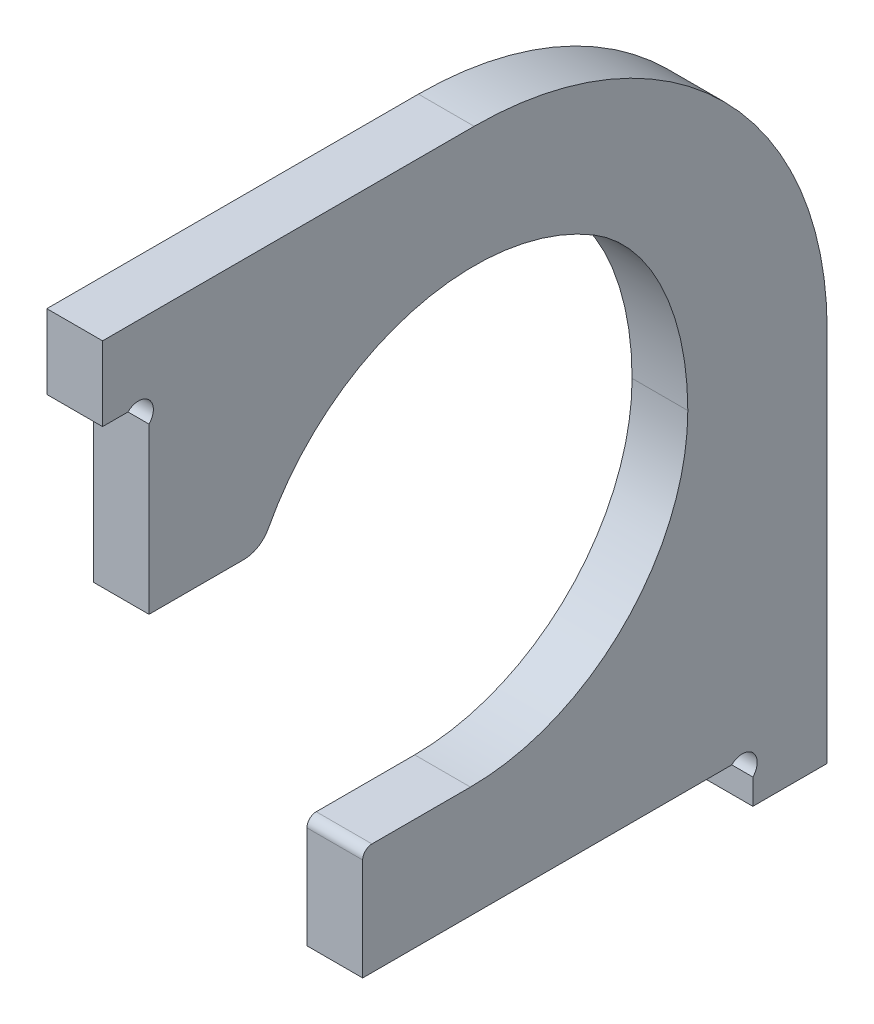
ISO-10303-21;
HEADER;
FILE_DESCRIPTION(('STEP AP214'),'2;1');
FILE_NAME('part.step','',(''),(''),'','','');
FILE_SCHEMA(('AUTOMOTIVE_DESIGN { 1 0 10303 214 1 1 1 1 }'));
ENDSEC;
DATA;
#1=APPLICATION_CONTEXT('core data for automotive mechanical design processes');
#2=APPLICATION_PROTOCOL_DEFINITION('international standard','automotive_design',2000,#1);
#3=PRODUCT_CONTEXT('',#1,'mechanical');
#4=PRODUCT('Part','Part','',(#3));
#5=PRODUCT_RELATED_PRODUCT_CATEGORY('part','',(#4));
#6=PRODUCT_DEFINITION_FORMATION('','',#4);
#7=PRODUCT_DEFINITION_CONTEXT('part definition',#1,'design');
#8=PRODUCT_DEFINITION('design','',#6,#7);
#9=PRODUCT_DEFINITION_SHAPE('','',#8);
#10=(LENGTH_UNIT() NAMED_UNIT(*) SI_UNIT(.MILLI.,.METRE.));
#11=(NAMED_UNIT(*) PLANE_ANGLE_UNIT() SI_UNIT($,.RADIAN.));
#12=(NAMED_UNIT(*) SI_UNIT($,.STERADIAN.) SOLID_ANGLE_UNIT());
#13=UNCERTAINTY_MEASURE_WITH_UNIT(LENGTH_MEASURE(1.E-05),#10,'distance_accuracy_value','');
#14=(GEOMETRIC_REPRESENTATION_CONTEXT(3) GLOBAL_UNCERTAINTY_ASSIGNED_CONTEXT((#13)) GLOBAL_UNIT_ASSIGNED_CONTEXT((#10,
#11,#12)) REPRESENTATION_CONTEXT('',''));
#15=CARTESIAN_POINT('',(0.,0.,0.));
#16=DIRECTION('',(0.,0.,1.));
#17=DIRECTION('',(1.,0.,0.));
#18=AXIS2_PLACEMENT_3D('',#15,#16,#17);
#19=CARTESIAN_POINT('',(6.,79.4,-1.));
#20=DIRECTION('',(0.,0.,-1.));
#21=DIRECTION('',(0.,1.,0.));
#22=AXIS2_PLACEMENT_3D('',#19,#20,#21);
#23=PLANE('',#22);
#24=DIRECTION('',(0.,-1.,0.));
#25=VECTOR('',#24,1.);
#26=CARTESIAN_POINT('',(0.,79.4,-1.));
#27=LINE('',#26,#25);
#28=CARTESIAN_POINT('',(0.,79.4,-1.));
#29=VERTEX_POINT('',#28);
#30=CARTESIAN_POINT('',(0.,71.4,-1.));
#31=VERTEX_POINT('',#30);
#32=EDGE_CURVE('E194',#29,#31,#27,.T.);
#33=ORIENTED_EDGE('',*,*,#32,.T.);
#34=DIRECTION('',(-1.,0.,0.));
#35=VECTOR('',#34,1.);
#36=CARTESIAN_POINT('',(6.,71.4,-1.));
#37=LINE('',#36,#35);
#38=CARTESIAN_POINT('',(6.,71.4,-1.));
#39=VERTEX_POINT('',#38);
#40=EDGE_CURVE('E11',#39,#31,#37,.T.);
#41=ORIENTED_EDGE('',*,*,#40,.F.);
#42=DIRECTION('',(0.,-1.,0.));
#43=VECTOR('',#42,1.);
#44=CARTESIAN_POINT('',(6.,79.4,-1.));
#45=LINE('',#44,#43);
#46=CARTESIAN_POINT('',(6.,79.4,-1.));
#47=VERTEX_POINT('',#46);
#48=EDGE_CURVE('E230',#47,#39,#45,.T.);
#49=ORIENTED_EDGE('',*,*,#48,.F.);
#50=DIRECTION('',(-1.,0.,0.));
#51=VECTOR('',#50,1.);
#52=CARTESIAN_POINT('',(6.,79.4,-1.));
#53=LINE('',#52,#51);
#54=EDGE_CURVE('E190',#47,#29,#53,.T.);
#55=ORIENTED_EDGE('',*,*,#54,.T.);
#56=EDGE_LOOP('',(#33,#41,#49,#55));
#57=FACE_BOUND('',#56,.T.);
#58=ADVANCED_FACE('F32',(#57),#23,.F.);
#59=CARTESIAN_POINT('',(6.,71.4,-1.));
#60=DIRECTION('',(0.,1.,-1.16609060809529E-13));
#61=DIRECTION('',(0.,1.16609060809529E-13,1.));
#62=AXIS2_PLACEMENT_3D('',#59,#60,#61);
#63=PLANE('',#62);
#64=DIRECTION('',(0.,-1.16609060809529E-13,-1.));
#65=VECTOR('',#64,1.);
#66=CARTESIAN_POINT('',(0.,71.4,-1.));
#67=LINE('',#66,#65);
#68=CARTESIAN_POINT('',(0.,71.3999999999997,-3.73725830020276));
#69=VERTEX_POINT('',#68);
#70=EDGE_CURVE('E197',#31,#69,#67,.T.);
#71=ORIENTED_EDGE('',*,*,#70,.T.);
#72=DIRECTION('',(-1.,0.,0.));
#73=VECTOR('',#72,1.);
#74=CARTESIAN_POINT('',(6.,71.3999999999997,-3.73725830020276));
#75=LINE('',#74,#73);
#76=CARTESIAN_POINT('',(6.,71.3999999999997,-3.73725830020276));
#77=VERTEX_POINT('',#76);
#78=EDGE_CURVE('E40',#77,#69,#75,.T.);
#79=ORIENTED_EDGE('',*,*,#78,.F.);
#80=DIRECTION('',(0.,-1.16609060809529E-13,-1.));
#81=VECTOR('',#80,1.);
#82=CARTESIAN_POINT('',(6.,71.4,-1.));
#83=LINE('',#82,#81);
#84=EDGE_CURVE('E124',#39,#77,#83,.T.);
#85=ORIENTED_EDGE('',*,*,#84,.F.);
#86=ORIENTED_EDGE('',*,*,#40,.T.);
#87=EDGE_LOOP('',(#71,#79,#85,#86));
#88=FACE_BOUND('',#87,.T.);
#89=ADVANCED_FACE('F330',(#88),#63,.F.);
#90=CARTESIAN_POINT('',(6.,70.2686291501015,-4.86862915010154));
#91=DIRECTION('',(-1.,0.,0.));
#92=DIRECTION('',(0.,0.,1.));
#93=AXIS2_PLACEMENT_3D('',#90,#91,#92);
#94=CYLINDRICAL_SURFACE('',#93,1.59999999999999);
#95=CARTESIAN_POINT('',(0.,70.2686291501015,-4.86862915010154));
#96=DIRECTION('',(-1.,0.,0.));
#97=DIRECTION('',(0.,0.,-1.));
#98=AXIS2_PLACEMENT_3D('',#95,#96,#97);
#99=CIRCLE('',#98,1.59999999999999);
#100=CARTESIAN_POINT('',(0.,69.137258300203,-6.));
#101=VERTEX_POINT('',#100);
#102=EDGE_CURVE('E199',#69,#101,#99,.T.);
#103=ORIENTED_EDGE('',*,*,#102,.T.);
#104=DIRECTION('',(-1.,0.,0.));
#105=VECTOR('',#104,1.);
#106=CARTESIAN_POINT('',(6.,69.137258300203,-6.));
#107=LINE('',#106,#105);
#108=CARTESIAN_POINT('',(6.,69.137258300203,-6.));
#109=VERTEX_POINT('',#108);
#110=EDGE_CURVE('E270',#109,#101,#107,.T.);
#111=ORIENTED_EDGE('',*,*,#110,.F.);
#112=CARTESIAN_POINT('',(6.,70.2686291501015,-4.86862915010154));
#113=DIRECTION('',(-1.,0.,0.));
#114=DIRECTION('',(0.,0.,-1.));
#115=AXIS2_PLACEMENT_3D('',#112,#113,#114);
#116=CIRCLE('',#115,1.59999999999999);
#117=EDGE_CURVE('E278',#77,#109,#116,.T.);
#118=ORIENTED_EDGE('',*,*,#117,.F.);
#119=ORIENTED_EDGE('',*,*,#78,.T.);
#120=EDGE_LOOP('',(#103,#111,#118,#119));
#121=FACE_BOUND('',#120,.T.);
#122=ADVANCED_FACE('F276',(#121),#94,.F.);
#123=CARTESIAN_POINT('',(6.,51.4,-6.));
#124=DIRECTION('',(0.,0.,-1.));
#125=DIRECTION('',(-1.,0.,0.));
#126=AXIS2_PLACEMENT_3D('',#123,#124,#125);
#127=PLANE('',#126);
#128=DIRECTION('',(0.,-1.,0.));
#129=VECTOR('',#128,1.);
#130=CARTESIAN_POINT('',(0.,51.4,-6.));
#131=LINE('',#130,#129);
#132=CARTESIAN_POINT('',(0.,51.4,-6.));
#133=VERTEX_POINT('',#132);
#134=EDGE_CURVE('E201',#101,#133,#131,.T.);
#135=ORIENTED_EDGE('',*,*,#134,.T.);
#136=DIRECTION('',(-1.,0.,0.));
#137=VECTOR('',#136,1.);
#138=CARTESIAN_POINT('',(6.,51.4,-6.));
#139=LINE('',#138,#137);
#140=CARTESIAN_POINT('',(6.,51.4,-6.));
#141=VERTEX_POINT('',#140);
#142=EDGE_CURVE('E267',#141,#133,#139,.T.);
#143=ORIENTED_EDGE('',*,*,#142,.F.);
#144=DIRECTION('',(0.,-1.,0.));
#145=VECTOR('',#144,1.);
#146=CARTESIAN_POINT('',(6.,51.4,-6.));
#147=LINE('',#146,#145);
#148=EDGE_CURVE('E296',#109,#141,#147,.T.);
#149=ORIENTED_EDGE('',*,*,#148,.F.);
#150=ORIENTED_EDGE('',*,*,#110,.T.);
#151=EDGE_LOOP('',(#135,#143,#149,#150));
#152=FACE_BOUND('',#151,.T.);
#153=ADVANCED_FACE('F287',(#152),#127,.F.);
#154=CARTESIAN_POINT('',(6.,51.4,-6.));
#155=DIRECTION('',(0.,1.,0.));
#156=DIRECTION('',(0.,0.,1.));
#157=AXIS2_PLACEMENT_3D('',#154,#155,#156);
#158=PLANE('',#157);
#159=DIRECTION('',(0.,0.,-1.));
#160=VECTOR('',#159,1.);
#161=CARTESIAN_POINT('',(0.,51.4,-6.));
#162=LINE('',#161,#160);
#163=CARTESIAN_POINT('',(0.,51.4,-16.2008064647256));
#164=VERTEX_POINT('',#163);
#165=EDGE_CURVE('E203',#133,#164,#162,.T.);
#166=ORIENTED_EDGE('',*,*,#165,.T.);
#167=DIRECTION('',(-1.,0.,0.));
#168=VECTOR('',#167,1.);
#169=CARTESIAN_POINT('',(6.,51.4,-16.2008064647256));
#170=LINE('',#169,#168);
#171=CARTESIAN_POINT('',(6.,51.4,-16.2008064647256));
#172=VERTEX_POINT('',#171);
#173=EDGE_CURVE('E264',#172,#164,#170,.T.);
#174=ORIENTED_EDGE('',*,*,#173,.F.);
#175=DIRECTION('',(0.,0.,-1.));
#176=VECTOR('',#175,1.);
#177=CARTESIAN_POINT('',(6.,51.4,-6.));
#178=LINE('',#177,#176);
#179=EDGE_CURVE('E293',#141,#172,#178,.T.);
#180=ORIENTED_EDGE('',*,*,#179,.F.);
#181=ORIENTED_EDGE('',*,*,#142,.T.);
#182=EDGE_LOOP('',(#166,#174,#180,#181));
#183=FACE_BOUND('',#182,.T.);
#184=ADVANCED_FACE('F291',(#183),#158,.F.);
#185=CARTESIAN_POINT('',(6.,54.4,-16.2008064647256));
#186=DIRECTION('',(-1.,0.,0.));
#187=DIRECTION('',(0.,0.,1.));
#188=AXIS2_PLACEMENT_3D('',#185,#186,#187);
#189=CYLINDRICAL_SURFACE('',#188,3.);
#190=CARTESIAN_POINT('',(0.,54.4,-16.2008064647256));
#191=DIRECTION('',(1.,0.,0.));
#192=DIRECTION('',(0.,0.,-1.));
#193=AXIS2_PLACEMENT_3D('',#190,#191,#192);
#194=CIRCLE('',#193,3.);
#195=CARTESIAN_POINT('',(0.,53.0071428571429,-18.8578629149336));
#196=VERTEX_POINT('',#195);
#197=EDGE_CURVE('E205',#164,#196,#194,.T.);
#198=ORIENTED_EDGE('',*,*,#197,.T.);
#199=DIRECTION('',(-1.,0.,0.));
#200=VECTOR('',#199,1.);
#201=CARTESIAN_POINT('',(6.,53.0071428571429,-18.8578629149336));
#202=LINE('',#201,#200);
#203=CARTESIAN_POINT('',(6.,53.0071428571429,-18.8578629149336));
#204=VERTEX_POINT('',#203);
#205=EDGE_CURVE('E261',#204,#196,#202,.T.);
#206=ORIENTED_EDGE('',*,*,#205,.F.);
#207=CARTESIAN_POINT('',(6.,54.4,-16.2008064647256));
#208=DIRECTION('',(1.,0.,0.));
#209=DIRECTION('',(0.,0.,-1.));
#210=AXIS2_PLACEMENT_3D('',#207,#208,#209);
#211=CIRCLE('',#210,3.);
#212=EDGE_CURVE('E295',#172,#204,#211,.T.);
#213=ORIENTED_EDGE('',*,*,#212,.F.);
#214=ORIENTED_EDGE('',*,*,#173,.T.);
#215=EDGE_LOOP('',(#198,#206,#213,#214));
#216=FACE_BOUND('',#215,.T.);
#217=ADVANCED_FACE('F320',(#216),#189,.T.);
#218=CARTESIAN_POINT('',(6.,41.4,-41.));
#219=DIRECTION('',(-1.,0.,0.));
#220=DIRECTION('',(0.,0.,1.));
#221=AXIS2_PLACEMENT_3D('',#218,#219,#220);
#222=CYLINDRICAL_SURFACE('',#221,24.9999999999999);
#223=CARTESIAN_POINT('',(0.,41.4,-41.));
#224=DIRECTION('',(-1.,0.,0.));
#225=DIRECTION('',(0.,0.,-1.));
#226=AXIS2_PLACEMENT_3D('',#223,#224,#225);
#227=CIRCLE('',#226,24.9999999999999);
#228=CARTESIAN_POINT('',(0.,62.8526343053635,-53.8368407858141));
#229=VERTEX_POINT('',#228);
#230=EDGE_CURVE('E207',#196,#229,#227,.T.);
#231=ORIENTED_EDGE('',*,*,#230,.T.);
#232=DIRECTION('',(-1.,0.,0.));
#233=VECTOR('',#232,1.);
#234=CARTESIAN_POINT('',(6.,62.8526343053635,-53.8368407858141));
#235=LINE('',#234,#233);
#236=CARTESIAN_POINT('',(6.,62.8526343053635,-53.8368407858141));
#237=VERTEX_POINT('',#236);
#238=EDGE_CURVE('E258',#237,#229,#235,.T.);
#239=ORIENTED_EDGE('',*,*,#238,.F.);
#240=CARTESIAN_POINT('',(6.,41.4,-41.));
#241=DIRECTION('',(-1.,0.,0.));
#242=DIRECTION('',(0.,0.,-1.));
#243=AXIS2_PLACEMENT_3D('',#240,#241,#242);
#244=CIRCLE('',#243,24.9999999999999);
#245=EDGE_CURVE('E298',#204,#237,#244,.T.);
#246=ORIENTED_EDGE('',*,*,#245,.F.);
#247=ORIENTED_EDGE('',*,*,#205,.T.);
#248=EDGE_LOOP('',(#231,#239,#246,#247));
#249=FACE_BOUND('',#248,.T.);
#250=ADVANCED_FACE('F315',(#249),#222,.F.);
#251=CARTESIAN_POINT('',(6.,41.4,-47.183641527081));
#252=DIRECTION('',(-1.,0.,0.));
#253=DIRECTION('',(0.,1.,0.));
#254=AXIS2_PLACEMENT_3D('',#251,#252,#253);
#255=ELLIPSE('',#254,23.3585440094265,16.8163584729185);
#256=DIRECTION('',(-1.,0.,0.));
#257=VECTOR('',#256,1.);
#258=SURFACE_OF_LINEAR_EXTRUSION('',#255,#257);
#259=CARTESIAN_POINT('',(0.,41.4,-47.183641527081));
#260=DIRECTION('',(-1.,0.,0.));
#261=DIRECTION('',(0.,1.,0.));
#262=AXIS2_PLACEMENT_3D('',#259,#260,#261);
#263=ELLIPSE('',#262,23.3585440094265,16.8163584729185);
#264=CARTESIAN_POINT('',(0.,41.4,-63.9999999999995));
#265=VERTEX_POINT('',#264);
#266=EDGE_CURVE('E209',#229,#265,#263,.T.);
#267=ORIENTED_EDGE('',*,*,#266,.T.);
#268=DIRECTION('',(-1.,0.,0.));
#269=VECTOR('',#268,1.);
#270=CARTESIAN_POINT('',(6.,41.4,-63.9999999999995));
#271=LINE('',#270,#269);
#272=CARTESIAN_POINT('',(6.,41.4,-63.9999999999995));
#273=VERTEX_POINT('',#272);
#274=EDGE_CURVE('E255',#273,#265,#271,.T.);
#275=ORIENTED_EDGE('',*,*,#274,.F.);
#276=EDGE_CURVE('E304',#237,#273,#255,.T.);
#277=ORIENTED_EDGE('',*,*,#276,.F.);
#278=ORIENTED_EDGE('',*,*,#238,.T.);
#279=EDGE_LOOP('',(#267,#275,#277,#278));
#280=FACE_BOUND('',#279,.T.);
#281=ADVANCED_FACE('F310',(#280),#258,.F.);
#282=CARTESIAN_POINT('',(6.,41.4,-40.5999999999994));
#283=DIRECTION('',(-1.,0.,0.));
#284=DIRECTION('',(0.,0.,1.));
#285=AXIS2_PLACEMENT_3D('',#282,#283,#284);
#286=CYLINDRICAL_SURFACE('',#285,23.4000000000001);
#287=CARTESIAN_POINT('',(0.,41.4,-40.5999999999994));
#288=DIRECTION('',(-1.,0.,0.));
#289=DIRECTION('',(0.,0.,-1.));
#290=AXIS2_PLACEMENT_3D('',#287,#288,#289);
#291=CIRCLE('',#290,23.4000000000001);
#292=CARTESIAN_POINT('',(0.,18.,-40.5999999999994));
#293=VERTEX_POINT('',#292);
#294=EDGE_CURVE('E211',#265,#293,#291,.T.);
#295=ORIENTED_EDGE('',*,*,#294,.T.);
#296=DIRECTION('',(-1.,0.,0.));
#297=VECTOR('',#296,1.);
#298=CARTESIAN_POINT('',(6.,18.,-40.5999999999994));
#299=LINE('',#298,#297);
#300=CARTESIAN_POINT('',(6.,18.,-40.5999999999994));
#301=VERTEX_POINT('',#300);
#302=EDGE_CURVE('E252',#301,#293,#299,.T.);
#303=ORIENTED_EDGE('',*,*,#302,.F.);
#304=CARTESIAN_POINT('',(6.,41.4,-40.5999999999994));
#305=DIRECTION('',(-1.,0.,0.));
#306=DIRECTION('',(0.,0.,-1.));
#307=AXIS2_PLACEMENT_3D('',#304,#305,#306);
#308=CIRCLE('',#307,23.4000000000001);
#309=EDGE_CURVE('E307',#273,#301,#308,.T.);
#310=ORIENTED_EDGE('',*,*,#309,.F.);
#311=ORIENTED_EDGE('',*,*,#274,.T.);
#312=EDGE_LOOP('',(#295,#303,#310,#311));
#313=FACE_BOUND('',#312,.T.);
#314=ADVANCED_FACE('F314',(#313),#286,.F.);
#315=CARTESIAN_POINT('',(6.,18.,-40.5999999999994));
#316=DIRECTION('',(0.,-1.,0.));
#317=DIRECTION('',(0.,0.,-1.));
#318=AXIS2_PLACEMENT_3D('',#315,#316,#317);
#319=PLANE('',#318);
#320=DIRECTION('',(0.,0.,1.));
#321=VECTOR('',#320,1.);
#322=CARTESIAN_POINT('',(0.,18.,-40.5999999999994));
#323=LINE('',#322,#321);
#324=CARTESIAN_POINT('',(0.,18.,-29.9999999999995));
#325=VERTEX_POINT('',#324);
#326=EDGE_CURVE('E213',#293,#325,#323,.T.);
#327=ORIENTED_EDGE('',*,*,#326,.T.);
#328=DIRECTION('',(-1.,0.,0.));
#329=VECTOR('',#328,1.);
#330=CARTESIAN_POINT('',(6.,18.,-29.9999999999995));
#331=LINE('',#330,#329);
#332=CARTESIAN_POINT('',(6.,18.,-29.9999999999995));
#333=VERTEX_POINT('',#332);
#334=EDGE_CURVE('E249',#333,#325,#331,.T.);
#335=ORIENTED_EDGE('',*,*,#334,.F.);
#336=DIRECTION('',(0.,0.,1.));
#337=VECTOR('',#336,1.);
#338=CARTESIAN_POINT('',(6.,18.,-40.5999999999994));
#339=LINE('',#338,#337);
#340=EDGE_CURVE('E379',#301,#333,#339,.T.);
#341=ORIENTED_EDGE('',*,*,#340,.F.);
#342=ORIENTED_EDGE('',*,*,#302,.T.);
#343=EDGE_LOOP('',(#327,#335,#341,#342));
#344=FACE_BOUND('',#343,.T.);
#345=ADVANCED_FACE('F376',(#344),#319,.F.);
#346=CARTESIAN_POINT('',(6.,17.,-29.9999999999995));
#347=DIRECTION('',(-1.,0.,0.));
#348=DIRECTION('',(0.,0.,1.));
#349=AXIS2_PLACEMENT_3D('',#346,#347,#348);
#350=CYLINDRICAL_SURFACE('',#349,1.);
#351=CARTESIAN_POINT('',(0.,17.,-29.9999999999995));
#352=DIRECTION('',(1.,0.,0.));
#353=DIRECTION('',(0.,0.,-1.));
#354=AXIS2_PLACEMENT_3D('',#351,#352,#353);
#355=CIRCLE('',#354,1.);
#356=CARTESIAN_POINT('',(0.,17.,-28.9999999999995));
#357=VERTEX_POINT('',#356);
#358=EDGE_CURVE('E215',#325,#357,#355,.T.);
#359=ORIENTED_EDGE('',*,*,#358,.T.);
#360=DIRECTION('',(-1.,0.,0.));
#361=VECTOR('',#360,1.);
#362=CARTESIAN_POINT('',(6.,17.,-28.9999999999995));
#363=LINE('',#362,#361);
#364=CARTESIAN_POINT('',(6.,17.,-28.9999999999995));
#365=VERTEX_POINT('',#364);
#366=EDGE_CURVE('E246',#365,#357,#363,.T.);
#367=ORIENTED_EDGE('',*,*,#366,.F.);
#368=CARTESIAN_POINT('',(6.,17.,-29.9999999999995));
#369=DIRECTION('',(1.,0.,0.));
#370=DIRECTION('',(0.,0.,-1.));
#371=AXIS2_PLACEMENT_3D('',#368,#369,#370);
#372=CIRCLE('',#371,1.);
#373=EDGE_CURVE('E370',#333,#365,#372,.T.);
#374=ORIENTED_EDGE('',*,*,#373,.F.);
#375=ORIENTED_EDGE('',*,*,#334,.T.);
#376=EDGE_LOOP('',(#359,#367,#374,#375));
#377=FACE_BOUND('',#376,.T.);
#378=ADVANCED_FACE('F369',(#377),#350,.T.);
#379=CARTESIAN_POINT('',(6.,17.,-28.9999999999995));
#380=DIRECTION('',(0.,0.,-1.));
#381=DIRECTION('',(-1.,0.,0.));
#382=AXIS2_PLACEMENT_3D('',#379,#380,#381);
#383=PLANE('',#382);
#384=DIRECTION('',(0.,-1.,0.));
#385=VECTOR('',#384,1.);
#386=CARTESIAN_POINT('',(0.,17.,-28.9999999999995));
#387=LINE('',#386,#385);
#388=CARTESIAN_POINT('',(0.,6.,-28.9999999999995));
#389=VERTEX_POINT('',#388);
#390=EDGE_CURVE('E217',#357,#389,#387,.T.);
#391=ORIENTED_EDGE('',*,*,#390,.T.);
#392=DIRECTION('',(-1.,0.,0.));
#393=VECTOR('',#392,1.);
#394=CARTESIAN_POINT('',(6.,6.,-28.9999999999995));
#395=LINE('',#394,#393);
#396=CARTESIAN_POINT('',(6.,6.,-28.9999999999995));
#397=VERTEX_POINT('',#396);
#398=EDGE_CURVE('E243',#397,#389,#395,.T.);
#399=ORIENTED_EDGE('',*,*,#398,.F.);
#400=DIRECTION('',(0.,-1.,0.));
#401=VECTOR('',#400,1.);
#402=CARTESIAN_POINT('',(6.,17.,-28.9999999999995));
#403=LINE('',#402,#401);
#404=EDGE_CURVE('E365',#365,#397,#403,.T.);
#405=ORIENTED_EDGE('',*,*,#404,.F.);
#406=ORIENTED_EDGE('',*,*,#366,.T.);
#407=EDGE_LOOP('',(#391,#399,#405,#406));
#408=FACE_BOUND('',#407,.T.);
#409=ADVANCED_FACE('F364',(#408),#383,.F.);
#410=CARTESIAN_POINT('',(6.,6.,-28.9999999999995));
#411=DIRECTION('',(0.,1.,0.));
#412=DIRECTION('',(0.,0.,1.));
#413=AXIS2_PLACEMENT_3D('',#410,#411,#412);
#414=PLANE('',#413);
#415=DIRECTION('',(0.,0.,-1.));
#416=VECTOR('',#415,1.);
#417=CARTESIAN_POINT('',(0.,6.,-28.9999999999995));
#418=LINE('',#417,#416);
#419=CARTESIAN_POINT('',(0.,6.,-68.7372583002031));
#420=VERTEX_POINT('',#419);
#421=EDGE_CURVE('E219',#389,#420,#418,.T.);
#422=ORIENTED_EDGE('',*,*,#421,.T.);
#423=DIRECTION('',(-1.,0.,0.));
#424=VECTOR('',#423,1.);
#425=CARTESIAN_POINT('',(6.,6.,-68.7372583002031));
#426=LINE('',#425,#424);
#427=CARTESIAN_POINT('',(6.,6.,-68.7372583002031));
#428=VERTEX_POINT('',#427);
#429=EDGE_CURVE('E240',#428,#420,#426,.T.);
#430=ORIENTED_EDGE('',*,*,#429,.F.);
#431=DIRECTION('',(0.,0.,-1.));
#432=VECTOR('',#431,1.);
#433=CARTESIAN_POINT('',(6.,6.,-28.9999999999995));
#434=LINE('',#433,#432);
#435=EDGE_CURVE('E361',#397,#428,#434,.T.);
#436=ORIENTED_EDGE('',*,*,#435,.F.);
#437=ORIENTED_EDGE('',*,*,#398,.T.);
#438=EDGE_LOOP('',(#422,#430,#436,#437));
#439=FACE_BOUND('',#438,.T.);
#440=ADVANCED_FACE('F358',(#439),#414,.F.);
#441=CARTESIAN_POINT('',(6.,4.86862915010152,-69.8686291501015));
#442=DIRECTION('',(-1.,0.,0.));
#443=DIRECTION('',(0.,0.,1.));
#444=AXIS2_PLACEMENT_3D('',#441,#442,#443);
#445=CYLINDRICAL_SURFACE('',#444,1.59999999999999);
#446=CARTESIAN_POINT('',(0.,4.86862915010152,-69.8686291501015));
#447=DIRECTION('',(-1.,0.,0.));
#448=DIRECTION('',(0.,0.,-1.));
#449=AXIS2_PLACEMENT_3D('',#446,#447,#448);
#450=CIRCLE('',#449,1.59999999999999);
#451=CARTESIAN_POINT('',(0.,3.73725830020235,-70.9999999999993));
#452=VERTEX_POINT('',#451);
#453=EDGE_CURVE('E221',#420,#452,#450,.T.);
#454=ORIENTED_EDGE('',*,*,#453,.T.);
#455=DIRECTION('',(-1.,0.,0.));
#456=VECTOR('',#455,1.);
#457=CARTESIAN_POINT('',(6.,3.73725830020235,-70.9999999999993));
#458=LINE('',#457,#456);
#459=CARTESIAN_POINT('',(6.,3.73725830020235,-70.9999999999993));
#460=VERTEX_POINT('',#459);
#461=EDGE_CURVE('E237',#460,#452,#458,.T.);
#462=ORIENTED_EDGE('',*,*,#461,.F.);
#463=CARTESIAN_POINT('',(6.,4.86862915010152,-69.8686291501015));
#464=DIRECTION('',(-1.,0.,0.));
#465=DIRECTION('',(0.,0.,-1.));
#466=AXIS2_PLACEMENT_3D('',#463,#464,#465);
#467=CIRCLE('',#466,1.59999999999999);
#468=EDGE_CURVE('E352',#428,#460,#467,.T.);
#469=ORIENTED_EDGE('',*,*,#468,.F.);
#470=ORIENTED_EDGE('',*,*,#429,.T.);
#471=EDGE_LOOP('',(#454,#462,#469,#470));
#472=FACE_BOUND('',#471,.T.);
#473=ADVANCED_FACE('F351',(#472),#445,.F.);
#474=CARTESIAN_POINT('',(6.,3.73725830020235,-70.9999999999993));
#475=DIRECTION('',(0.,2.53497958281624E-13,-1.));
#476=DIRECTION('',(0.,1.,2.53497958281624E-13));
#477=AXIS2_PLACEMENT_3D('',#474,#475,#476);
#478=PLANE('',#477);
#479=DIRECTION('',(0.,-1.,-2.53497958281624E-13));
#480=VECTOR('',#479,1.);
#481=CARTESIAN_POINT('',(0.,3.73725830020235,-70.9999999999993));
#482=LINE('',#481,#480);
#483=CARTESIAN_POINT('',(0.,0.999999999999997,-71.));
#484=VERTEX_POINT('',#483);
#485=EDGE_CURVE('E223',#452,#484,#482,.T.);
#486=ORIENTED_EDGE('',*,*,#485,.T.);
#487=DIRECTION('',(-1.,0.,0.));
#488=VECTOR('',#487,1.);
#489=CARTESIAN_POINT('',(6.,0.999999999999997,-71.));
#490=LINE('',#489,#488);
#491=CARTESIAN_POINT('',(6.,0.999999999999997,-71.));
#492=VERTEX_POINT('',#491);
#493=EDGE_CURVE('E234',#492,#484,#490,.T.);
#494=ORIENTED_EDGE('',*,*,#493,.F.);
#495=DIRECTION('',(0.,-1.,-2.53497958281624E-13));
#496=VECTOR('',#495,1.);
#497=CARTESIAN_POINT('',(6.,3.73725830020235,-70.9999999999993));
#498=LINE('',#497,#496);
#499=EDGE_CURVE('E347',#460,#492,#498,.T.);
#500=ORIENTED_EDGE('',*,*,#499,.F.);
#501=ORIENTED_EDGE('',*,*,#461,.T.);
#502=EDGE_LOOP('',(#486,#494,#500,#501));
#503=FACE_BOUND('',#502,.T.);
#504=ADVANCED_FACE('F346',(#503),#478,.F.);
#505=CARTESIAN_POINT('',(6.,0.999999999999997,-71.));
#506=DIRECTION('',(0.,1.,0.));
#507=DIRECTION('',(0.,0.,1.));
#508=AXIS2_PLACEMENT_3D('',#505,#506,#507);
#509=PLANE('',#508);
#510=DIRECTION('',(0.,0.,-1.));
#511=VECTOR('',#510,1.);
#512=CARTESIAN_POINT('',(0.,0.999999999999997,-71.));
#513=LINE('',#512,#511);
#514=CARTESIAN_POINT('',(0.,1.,-79.));
#515=VERTEX_POINT('',#514);
#516=EDGE_CURVE('E225',#484,#515,#513,.T.);
#517=ORIENTED_EDGE('',*,*,#516,.T.);
#518=DIRECTION('',(-1.,0.,0.));
#519=VECTOR('',#518,1.);
#520=CARTESIAN_POINT('',(6.,1.,-79.));
#521=LINE('',#520,#519);
#522=CARTESIAN_POINT('',(6.,1.,-79.));
#523=VERTEX_POINT('',#522);
#524=EDGE_CURVE('E185',#523,#515,#521,.T.);
#525=ORIENTED_EDGE('',*,*,#524,.F.);
#526=DIRECTION('',(0.,0.,-1.));
#527=VECTOR('',#526,1.);
#528=CARTESIAN_POINT('',(6.,0.999999999999997,-71.));
#529=LINE('',#528,#527);
#530=EDGE_CURVE('E176',#492,#523,#529,.T.);
#531=ORIENTED_EDGE('',*,*,#530,.F.);
#532=ORIENTED_EDGE('',*,*,#493,.T.);
#533=EDGE_LOOP('',(#517,#525,#531,#532));
#534=FACE_BOUND('',#533,.T.);
#535=ADVANCED_FACE('F342',(#534),#509,.F.);
#536=CARTESIAN_POINT('',(6.,41.4,-79.));
#537=DIRECTION('',(0.,0.,1.));
#538=DIRECTION('',(1.,0.,0.));
#539=AXIS2_PLACEMENT_3D('',#536,#537,#538);
#540=PLANE('',#539);
#541=DIRECTION('',(0.,1.,0.));
#542=VECTOR('',#541,1.);
#543=CARTESIAN_POINT('',(0.,41.4,-79.));
#544=LINE('',#543,#542);
#545=CARTESIAN_POINT('',(0.,41.4,-79.));
#546=VERTEX_POINT('',#545);
#547=EDGE_CURVE('E184',#515,#546,#544,.T.);
#548=ORIENTED_EDGE('',*,*,#547,.T.);
#549=DIRECTION('',(-1.,0.,0.));
#550=VECTOR('',#549,1.);
#551=CARTESIAN_POINT('',(6.,41.4,-79.));
#552=LINE('',#551,#550);
#553=CARTESIAN_POINT('',(6.,41.4,-79.));
#554=VERTEX_POINT('',#553);
#555=EDGE_CURVE('E181',#554,#546,#552,.T.);
#556=ORIENTED_EDGE('',*,*,#555,.F.);
#557=DIRECTION('',(0.,1.,0.));
#558=VECTOR('',#557,1.);
#559=CARTESIAN_POINT('',(6.,41.4,-79.));
#560=LINE('',#559,#558);
#561=EDGE_CURVE('E170',#523,#554,#560,.T.);
#562=ORIENTED_EDGE('',*,*,#561,.F.);
#563=ORIENTED_EDGE('',*,*,#524,.T.);
#564=EDGE_LOOP('',(#548,#556,#562,#563));
#565=FACE_BOUND('',#564,.T.);
#566=ADVANCED_FACE('F182',(#565),#540,.F.);
#567=CARTESIAN_POINT('',(6.,41.4,-41.));
#568=DIRECTION('',(-1.,0.,0.));
#569=DIRECTION('',(0.,0.,1.));
#570=AXIS2_PLACEMENT_3D('',#567,#568,#569);
#571=CYLINDRICAL_SURFACE('',#570,38.);
#572=CARTESIAN_POINT('',(0.,41.4,-41.));
#573=DIRECTION('',(1.,0.,0.));
#574=DIRECTION('',(0.,0.,-1.));
#575=AXIS2_PLACEMENT_3D('',#572,#573,#574);
#576=CIRCLE('',#575,38.);
#577=CARTESIAN_POINT('',(0.,79.4,-41.));
#578=VERTEX_POINT('',#577);
#579=EDGE_CURVE('E110',#546,#578,#576,.T.);
#580=ORIENTED_EDGE('',*,*,#579,.T.);
#581=DIRECTION('',(-1.,0.,0.));
#582=VECTOR('',#581,1.);
#583=CARTESIAN_POINT('',(6.,79.4,-41.));
#584=LINE('',#583,#582);
#585=CARTESIAN_POINT('',(6.,79.4,-41.));
#586=VERTEX_POINT('',#585);
#587=EDGE_CURVE('E186',#586,#578,#584,.T.);
#588=ORIENTED_EDGE('',*,*,#587,.F.);
#589=CARTESIAN_POINT('',(6.,41.4,-41.));
#590=DIRECTION('',(1.,0.,0.));
#591=DIRECTION('',(0.,0.,-1.));
#592=AXIS2_PLACEMENT_3D('',#589,#590,#591);
#593=CIRCLE('',#592,38.);
#594=EDGE_CURVE('E174',#554,#586,#593,.T.);
#595=ORIENTED_EDGE('',*,*,#594,.F.);
#596=ORIENTED_EDGE('',*,*,#555,.T.);
#597=EDGE_LOOP('',(#580,#588,#595,#596));
#598=FACE_BOUND('',#597,.T.);
#599=ADVANCED_FACE('F188',(#598),#571,.T.);
#600=CARTESIAN_POINT('',(6.,79.4,-41.));
#601=DIRECTION('',(0.,-1.,0.));
#602=DIRECTION('',(0.,0.,-1.));
#603=AXIS2_PLACEMENT_3D('',#600,#601,#602);
#604=PLANE('',#603);
#605=DIRECTION('',(0.,0.,1.));
#606=VECTOR('',#605,1.);
#607=CARTESIAN_POINT('',(0.,79.4,-41.));
#608=LINE('',#607,#606);
#609=EDGE_CURVE('E116',#578,#29,#608,.T.);
#610=ORIENTED_EDGE('',*,*,#609,.T.);
#611=ORIENTED_EDGE('',*,*,#54,.F.);
#612=DIRECTION('',(0.,0.,1.));
#613=VECTOR('',#612,1.);
#614=CARTESIAN_POINT('',(6.,79.4,-41.));
#615=LINE('',#614,#613);
#616=EDGE_CURVE('E48',#586,#47,#615,.T.);
#617=ORIENTED_EDGE('',*,*,#616,.F.);
#618=ORIENTED_EDGE('',*,*,#587,.T.);
#619=EDGE_LOOP('',(#610,#611,#617,#618));
#620=FACE_BOUND('',#619,.T.);
#621=ADVANCED_FACE('F416',(#620),#604,.F.);
#622=CARTESIAN_POINT('',(6.,41.4,-47.183641527081));
#623=DIRECTION('',(1.,0.,0.));
#624=DIRECTION('',(0.,0.,-1.));
#625=AXIS2_PLACEMENT_3D('',#622,#623,#624);
#626=PLANE('',#625);
#627=ORIENTED_EDGE('',*,*,#48,.T.);
#628=ORIENTED_EDGE('',*,*,#84,.T.);
#629=ORIENTED_EDGE('',*,*,#117,.T.);
#630=ORIENTED_EDGE('',*,*,#148,.T.);
#631=ORIENTED_EDGE('',*,*,#179,.T.);
#632=ORIENTED_EDGE('',*,*,#212,.T.);
#633=ORIENTED_EDGE('',*,*,#245,.T.);
#634=ORIENTED_EDGE('',*,*,#276,.T.);
#635=ORIENTED_EDGE('',*,*,#309,.T.);
#636=ORIENTED_EDGE('',*,*,#340,.T.);
#637=ORIENTED_EDGE('',*,*,#373,.T.);
#638=ORIENTED_EDGE('',*,*,#404,.T.);
#639=ORIENTED_EDGE('',*,*,#435,.T.);
#640=ORIENTED_EDGE('',*,*,#468,.T.);
#641=ORIENTED_EDGE('',*,*,#499,.T.);
#642=ORIENTED_EDGE('',*,*,#530,.T.);
#643=ORIENTED_EDGE('',*,*,#561,.T.);
#644=ORIENTED_EDGE('',*,*,#594,.T.);
#645=ORIENTED_EDGE('',*,*,#616,.T.);
#646=EDGE_LOOP('',(#627,#628,#629,#630,#631,#632,#633,#634,#635,#636,#637,#638,#639,#640,#641,
#642,#643,#644,#645));
#647=FACE_BOUND('',#646,.T.);
#648=ADVANCED_FACE('F172',(#647),#626,.T.);
#649=CARTESIAN_POINT('',(0.,41.4,-47.183641527081));
#650=DIRECTION('',(1.,0.,0.));
#651=DIRECTION('',(0.,0.,-1.));
#652=AXIS2_PLACEMENT_3D('',#649,#650,#651);
#653=PLANE('',#652);
#654=ORIENTED_EDGE('',*,*,#32,.F.);
#655=ORIENTED_EDGE('',*,*,#609,.F.);
#656=ORIENTED_EDGE('',*,*,#579,.F.);
#657=ORIENTED_EDGE('',*,*,#547,.F.);
#658=ORIENTED_EDGE('',*,*,#516,.F.);
#659=ORIENTED_EDGE('',*,*,#485,.F.);
#660=ORIENTED_EDGE('',*,*,#453,.F.);
#661=ORIENTED_EDGE('',*,*,#421,.F.);
#662=ORIENTED_EDGE('',*,*,#390,.F.);
#663=ORIENTED_EDGE('',*,*,#358,.F.);
#664=ORIENTED_EDGE('',*,*,#326,.F.);
#665=ORIENTED_EDGE('',*,*,#294,.F.);
#666=ORIENTED_EDGE('',*,*,#266,.F.);
#667=ORIENTED_EDGE('',*,*,#230,.F.);
#668=ORIENTED_EDGE('',*,*,#197,.F.);
#669=ORIENTED_EDGE('',*,*,#165,.F.);
#670=ORIENTED_EDGE('',*,*,#134,.F.);
#671=ORIENTED_EDGE('',*,*,#102,.F.);
#672=ORIENTED_EDGE('',*,*,#70,.F.);
#673=EDGE_LOOP('',(#654,#655,#656,#657,#658,#659,#660,#661,#662,#663,#664,#665,#666,#667,#668,
#669,#670,#671,#672));
#674=FACE_BOUND('',#673,.T.);
#675=ADVANCED_FACE('F282',(#674),#653,.F.);
#676=CLOSED_SHELL('',(#58,#89,#122,#153,#184,#217,#250,#281,#314,#345,#378,#409,#440,#473,#504,
#535,#566,#599,#621,#648,#675));
#677=MANIFOLD_SOLID_BREP('B2',#676);
#678=ADVANCED_BREP_SHAPE_REPRESENTATION('',(#18,#677),#14);
#679=SHAPE_DEFINITION_REPRESENTATION(#9,#678);
ENDSEC;
END-ISO-10303-21;
